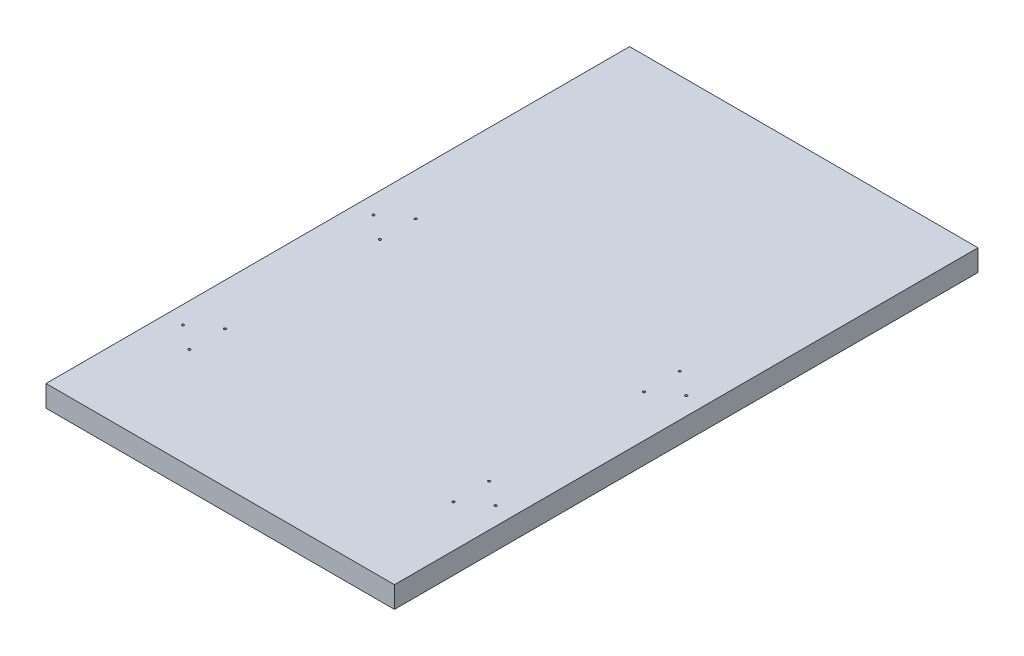
ISO-10303-21;
HEADER;
FILE_DESCRIPTION(('STEP AP214'),'2;1');
FILE_NAME('part.step','',(''),(''),'','','');
FILE_SCHEMA(('AUTOMOTIVE_DESIGN { 1 0 10303 214 1 1 1 1 }'));
ENDSEC;
DATA;
#1=APPLICATION_CONTEXT('core data for automotive mechanical design processes');
#2=APPLICATION_PROTOCOL_DEFINITION('international standard','automotive_design',2000,#1);
#3=PRODUCT_CONTEXT('',#1,'mechanical');
#4=PRODUCT('Part','Part','',(#3));
#5=PRODUCT_RELATED_PRODUCT_CATEGORY('part','',(#4));
#6=PRODUCT_DEFINITION_FORMATION('','',#4);
#7=PRODUCT_DEFINITION_CONTEXT('part definition',#1,'design');
#8=PRODUCT_DEFINITION('design','',#6,#7);
#9=PRODUCT_DEFINITION_SHAPE('','',#8);
#10=(LENGTH_UNIT() NAMED_UNIT(*) SI_UNIT(.MILLI.,.METRE.));
#11=(NAMED_UNIT(*) PLANE_ANGLE_UNIT() SI_UNIT($,.RADIAN.));
#12=(NAMED_UNIT(*) SI_UNIT($,.STERADIAN.) SOLID_ANGLE_UNIT());
#13=UNCERTAINTY_MEASURE_WITH_UNIT(LENGTH_MEASURE(1.E-05),#10,'distance_accuracy_value','');
#14=(GEOMETRIC_REPRESENTATION_CONTEXT(3) GLOBAL_UNCERTAINTY_ASSIGNED_CONTEXT((#13)) GLOBAL_UNIT_ASSIGNED_CONTEXT((#10,
#11,#12)) REPRESENTATION_CONTEXT('',''));
#15=CARTESIAN_POINT('',(0.,0.,0.));
#16=DIRECTION('',(0.,0.,1.));
#17=DIRECTION('',(1.,0.,0.));
#18=AXIS2_PLACEMENT_3D('',#15,#16,#17);
#19=CARTESIAN_POINT('',(0.,18.,0.));
#20=DIRECTION('',(0.,-1.,0.));
#21=DIRECTION('',(0.,0.,-1.));
#22=AXIS2_PLACEMENT_3D('',#19,#20,#21);
#23=PLANE('',#22);
#24=CARTESIAN_POINT('',(118.714236711216,18.,-40.));
#25=DIRECTION('',(0.,1.,0.));
#26=DIRECTION('',(0.,0.,1.));
#27=AXIS2_PLACEMENT_3D('',#24,#25,#26);
#28=CIRCLE('',#27,0.999999999999941);
#29=CARTESIAN_POINT('',(118.714236711216,18.,-39.));
#30=VERTEX_POINT('',#29);
#31=EDGE_CURVE('E45',#30,#30,#28,.T.);
#32=ORIENTED_EDGE('',*,*,#31,.F.);
#33=EDGE_LOOP('',(#32));
#34=FACE_BOUND('',#33,.T.);
#35=CARTESIAN_POINT('',(118.714236711216,18.,-200.));
#36=DIRECTION('',(0.,1.,0.));
#37=DIRECTION('',(0.,0.,-1.));
#38=AXIS2_PLACEMENT_3D('',#35,#36,#37);
#39=CIRCLE('',#38,0.999999999999911);
#40=CARTESIAN_POINT('',(118.714236711216,18.,-201.));
#41=VERTEX_POINT('',#40);
#42=EDGE_CURVE('E131',#41,#41,#39,.T.);
#43=ORIENTED_EDGE('',*,*,#42,.F.);
#44=EDGE_LOOP('',(#43));
#45=FACE_BOUND('',#44,.T.);
#46=CARTESIAN_POINT('',(139.14,18.,-215.));
#47=DIRECTION('',(0.,1.,0.));
#48=DIRECTION('',(0.,0.,-1.));
#49=AXIS2_PLACEMENT_3D('',#46,#47,#48);
#50=CIRCLE('',#49,0.999999999999937);
#51=CARTESIAN_POINT('',(139.14,18.,-216.));
#52=VERTEX_POINT('',#51);
#53=EDGE_CURVE('E125',#52,#52,#50,.T.);
#54=ORIENTED_EDGE('',*,*,#53,.F.);
#55=EDGE_LOOP('',(#54));
#56=FACE_BOUND('',#55,.T.);
#57=CARTESIAN_POINT('',(381.285763288784,18.,-40.));
#58=DIRECTION('',(0.,1.,0.));
#59=DIRECTION('',(0.,0.,-1.));
#60=AXIS2_PLACEMENT_3D('',#57,#58,#59);
#61=CIRCLE('',#60,0.999999999999941);
#62=CARTESIAN_POINT('',(381.285763288784,18.,-40.9999999999999));
#63=VERTEX_POINT('',#62);
#64=EDGE_CURVE('E118',#63,#63,#61,.T.);
#65=ORIENTED_EDGE('',*,*,#64,.F.);
#66=EDGE_LOOP('',(#65));
#67=FACE_BOUND('',#66,.T.);
#68=CARTESIAN_POINT('',(139.14,18.,-25.));
#69=DIRECTION('',(0.,1.,0.));
#70=DIRECTION('',(0.,0.,1.));
#71=AXIS2_PLACEMENT_3D('',#68,#69,#70);
#72=CIRCLE('',#71,0.99999999999994);
#73=CARTESIAN_POINT('',(139.14,18.,-24.));
#74=VERTEX_POINT('',#73);
#75=EDGE_CURVE('E160',#74,#74,#72,.T.);
#76=ORIENTED_EDGE('',*,*,#75,.F.);
#77=EDGE_LOOP('',(#76));
#78=FACE_BOUND('',#77,.T.);
#79=CARTESIAN_POINT('',(139.14,18.,-55.));
#80=DIRECTION('',(0.,1.,0.));
#81=DIRECTION('',(0.,0.,1.));
#82=AXIS2_PLACEMENT_3D('',#79,#80,#81);
#83=CIRCLE('',#82,1.00000000000006);
#84=CARTESIAN_POINT('',(139.14,18.,-53.9999999999999));
#85=VERTEX_POINT('',#84);
#86=EDGE_CURVE('E166',#85,#85,#83,.T.);
#87=ORIENTED_EDGE('',*,*,#86,.F.);
#88=EDGE_LOOP('',(#87));
#89=FACE_BOUND('',#88,.T.);
#90=CARTESIAN_POINT('',(381.285763288784,18.,-200.));
#91=DIRECTION('',(0.,1.,0.));
#92=DIRECTION('',(0.,0.,1.));
#93=AXIS2_PLACEMENT_3D('',#90,#91,#92);
#94=CIRCLE('',#93,0.999999999999937);
#95=CARTESIAN_POINT('',(381.285763288784,18.,-199.));
#96=VERTEX_POINT('',#95);
#97=EDGE_CURVE('E172',#96,#96,#94,.T.);
#98=ORIENTED_EDGE('',*,*,#97,.F.);
#99=EDGE_LOOP('',(#98));
#100=FACE_BOUND('',#99,.T.);
#101=CARTESIAN_POINT('',(360.86,18.,-215.));
#102=DIRECTION('',(0.,1.,0.));
#103=DIRECTION('',(0.,0.,1.));
#104=AXIS2_PLACEMENT_3D('',#101,#102,#103);
#105=CIRCLE('',#104,0.999999999999937);
#106=CARTESIAN_POINT('',(360.86,18.,-214.));
#107=VERTEX_POINT('',#106);
#108=EDGE_CURVE('E178',#107,#107,#105,.T.);
#109=ORIENTED_EDGE('',*,*,#108,.F.);
#110=EDGE_LOOP('',(#109));
#111=FACE_BOUND('',#110,.T.);
#112=CARTESIAN_POINT('',(360.86,18.,-185.));
#113=DIRECTION('',(0.,1.,0.));
#114=DIRECTION('',(0.,0.,1.));
#115=AXIS2_PLACEMENT_3D('',#112,#113,#114);
#116=CIRCLE('',#115,1.00000000000006);
#117=CARTESIAN_POINT('',(360.86,18.,-184.));
#118=VERTEX_POINT('',#117);
#119=EDGE_CURVE('E136',#118,#118,#116,.T.);
#120=ORIENTED_EDGE('',*,*,#119,.F.);
#121=EDGE_LOOP('',(#120));
#122=FACE_BOUND('',#121,.T.);
#123=CARTESIAN_POINT('',(139.14,18.,-185.));
#124=DIRECTION('',(0.,1.,0.));
#125=DIRECTION('',(0.,0.,-1.));
#126=AXIS2_PLACEMENT_3D('',#123,#124,#125);
#127=CIRCLE('',#126,1.00000000000006);
#128=CARTESIAN_POINT('',(139.14,18.,-186.));
#129=VERTEX_POINT('',#128);
#130=EDGE_CURVE('E143',#129,#129,#127,.T.);
#131=ORIENTED_EDGE('',*,*,#130,.F.);
#132=EDGE_LOOP('',(#131));
#133=FACE_BOUND('',#132,.T.);
#134=CARTESIAN_POINT('',(360.86,18.,-55.));
#135=DIRECTION('',(0.,1.,0.));
#136=DIRECTION('',(0.,0.,-1.));
#137=AXIS2_PLACEMENT_3D('',#134,#135,#136);
#138=CIRCLE('',#137,1.00000000000006);
#139=CARTESIAN_POINT('',(360.86,18.,-56.0000000000001));
#140=VERTEX_POINT('',#139);
#141=EDGE_CURVE('E149',#140,#140,#138,.T.);
#142=ORIENTED_EDGE('',*,*,#141,.F.);
#143=EDGE_LOOP('',(#142));
#144=FACE_BOUND('',#143,.T.);
#145=CARTESIAN_POINT('',(360.86,18.,-25.));
#146=DIRECTION('',(0.,1.,0.));
#147=DIRECTION('',(0.,0.,-1.));
#148=AXIS2_PLACEMENT_3D('',#145,#146,#147);
#149=CIRCLE('',#148,0.99999999999994);
#150=CARTESIAN_POINT('',(360.86,18.,-25.9999999999999));
#151=VERTEX_POINT('',#150);
#152=EDGE_CURVE('E155',#151,#151,#149,.T.);
#153=ORIENTED_EDGE('',*,*,#152,.F.);
#154=EDGE_LOOP('',(#153));
#155=FACE_BOUND('',#154,.T.);
#156=DIRECTION('',(0.,0.,1.));
#157=VECTOR('',#156,1.);
#158=CARTESIAN_POINT('',(103.714236711216,18.,-230.));
#159=LINE('',#158,#157);
#160=CARTESIAN_POINT('',(103.714236711216,18.,-430.));
#161=VERTEX_POINT('',#160);
#162=CARTESIAN_POINT('',(103.714236711216,18.,60.));
#163=VERTEX_POINT('',#162);
#164=EDGE_CURVE('E64',#161,#163,#159,.T.);
#165=ORIENTED_EDGE('',*,*,#164,.T.);
#166=DIRECTION('',(-1.,0.,0.));
#167=VECTOR('',#166,1.);
#168=CARTESIAN_POINT('',(103.714236711216,18.,60.));
#169=LINE('',#168,#167);
#170=CARTESIAN_POINT('',(396.285763288784,18.,60.));
#171=VERTEX_POINT('',#170);
#172=EDGE_CURVE('E101',#171,#163,#169,.T.);
#173=ORIENTED_EDGE('',*,*,#172,.F.);
#174=DIRECTION('',(0.,0.,-1.));
#175=VECTOR('',#174,1.);
#176=CARTESIAN_POINT('',(396.285763288784,18.,-230.));
#177=LINE('',#176,#175);
#178=CARTESIAN_POINT('',(396.285763288784,18.,-430.));
#179=VERTEX_POINT('',#178);
#180=EDGE_CURVE('E56',#171,#179,#177,.T.);
#181=ORIENTED_EDGE('',*,*,#180,.T.);
#182=DIRECTION('',(1.,0.,0.));
#183=VECTOR('',#182,1.);
#184=CARTESIAN_POINT('',(396.285763288784,18.,-430.));
#185=LINE('',#184,#183);
#186=EDGE_CURVE('E112',#161,#179,#185,.T.);
#187=ORIENTED_EDGE('',*,*,#186,.F.);
#188=EDGE_LOOP('',(#165,#173,#181,#187));
#189=FACE_BOUND('',#188,.T.);
#190=ADVANCED_FACE('F41',(#34,#45,#56,#67,#78,#89,#100,#111,#122,#133,#144,#155,#189),#23,.F.);
#191=CARTESIAN_POINT('',(0.,0.,0.));
#192=DIRECTION('',(0.,-1.,0.));
#193=DIRECTION('',(0.,0.,-1.));
#194=AXIS2_PLACEMENT_3D('',#191,#192,#193);
#195=PLANE('',#194);
#196=CARTESIAN_POINT('',(118.714236711216,0.,-40.));
#197=DIRECTION('',(0.,1.,0.));
#198=DIRECTION('',(0.,0.,1.));
#199=AXIS2_PLACEMENT_3D('',#196,#197,#198);
#200=CIRCLE('',#199,0.999999999999941);
#201=CARTESIAN_POINT('',(118.714236711216,0.,-39.));
#202=VERTEX_POINT('',#201);
#203=EDGE_CURVE('E11',#202,#202,#200,.T.);
#204=ORIENTED_EDGE('',*,*,#203,.T.);
#205=EDGE_LOOP('',(#204));
#206=FACE_BOUND('',#205,.T.);
#207=CARTESIAN_POINT('',(118.714236711216,0.,-200.));
#208=DIRECTION('',(0.,1.,0.));
#209=DIRECTION('',(0.,0.,-1.));
#210=AXIS2_PLACEMENT_3D('',#207,#208,#209);
#211=CIRCLE('',#210,0.999999999999911);
#212=CARTESIAN_POINT('',(118.714236711216,0.,-201.));
#213=VERTEX_POINT('',#212);
#214=EDGE_CURVE('E115',#213,#213,#211,.T.);
#215=ORIENTED_EDGE('',*,*,#214,.T.);
#216=EDGE_LOOP('',(#215));
#217=FACE_BOUND('',#216,.T.);
#218=CARTESIAN_POINT('',(139.14,0.,-215.));
#219=DIRECTION('',(0.,1.,0.));
#220=DIRECTION('',(0.,0.,-1.));
#221=AXIS2_PLACEMENT_3D('',#218,#219,#220);
#222=CIRCLE('',#221,0.999999999999937);
#223=CARTESIAN_POINT('',(139.14,0.,-216.));
#224=VERTEX_POINT('',#223);
#225=EDGE_CURVE('E128',#224,#224,#222,.T.);
#226=ORIENTED_EDGE('',*,*,#225,.T.);
#227=EDGE_LOOP('',(#226));
#228=FACE_BOUND('',#227,.T.);
#229=CARTESIAN_POINT('',(381.285763288784,0.,-40.));
#230=DIRECTION('',(0.,1.,0.));
#231=DIRECTION('',(0.,0.,-1.));
#232=AXIS2_PLACEMENT_3D('',#229,#230,#231);
#233=CIRCLE('',#232,0.999999999999941);
#234=CARTESIAN_POINT('',(381.285763288784,0.,-40.9999999999999));
#235=VERTEX_POINT('',#234);
#236=EDGE_CURVE('E122',#235,#235,#233,.T.);
#237=ORIENTED_EDGE('',*,*,#236,.T.);
#238=EDGE_LOOP('',(#237));
#239=FACE_BOUND('',#238,.T.);
#240=CARTESIAN_POINT('',(139.14,0.,-25.));
#241=DIRECTION('',(0.,1.,0.));
#242=DIRECTION('',(0.,0.,1.));
#243=AXIS2_PLACEMENT_3D('',#240,#241,#242);
#244=CIRCLE('',#243,0.99999999999994);
#245=CARTESIAN_POINT('',(139.14,0.,-24.));
#246=VERTEX_POINT('',#245);
#247=EDGE_CURVE('E163',#246,#246,#244,.T.);
#248=ORIENTED_EDGE('',*,*,#247,.T.);
#249=EDGE_LOOP('',(#248));
#250=FACE_BOUND('',#249,.T.);
#251=CARTESIAN_POINT('',(139.14,0.,-55.));
#252=DIRECTION('',(0.,1.,0.));
#253=DIRECTION('',(0.,0.,1.));
#254=AXIS2_PLACEMENT_3D('',#251,#252,#253);
#255=CIRCLE('',#254,1.00000000000006);
#256=CARTESIAN_POINT('',(139.14,0.,-53.9999999999999));
#257=VERTEX_POINT('',#256);
#258=EDGE_CURVE('E169',#257,#257,#255,.T.);
#259=ORIENTED_EDGE('',*,*,#258,.T.);
#260=EDGE_LOOP('',(#259));
#261=FACE_BOUND('',#260,.T.);
#262=CARTESIAN_POINT('',(381.285763288784,0.,-200.));
#263=DIRECTION('',(0.,1.,0.));
#264=DIRECTION('',(0.,0.,1.));
#265=AXIS2_PLACEMENT_3D('',#262,#263,#264);
#266=CIRCLE('',#265,0.999999999999937);
#267=CARTESIAN_POINT('',(381.285763288784,0.,-199.));
#268=VERTEX_POINT('',#267);
#269=EDGE_CURVE('E175',#268,#268,#266,.T.);
#270=ORIENTED_EDGE('',*,*,#269,.T.);
#271=EDGE_LOOP('',(#270));
#272=FACE_BOUND('',#271,.T.);
#273=CARTESIAN_POINT('',(360.86,0.,-215.));
#274=DIRECTION('',(0.,1.,0.));
#275=DIRECTION('',(0.,0.,1.));
#276=AXIS2_PLACEMENT_3D('',#273,#274,#275);
#277=CIRCLE('',#276,0.999999999999937);
#278=CARTESIAN_POINT('',(360.86,0.,-214.));
#279=VERTEX_POINT('',#278);
#280=EDGE_CURVE('E139',#279,#279,#277,.T.);
#281=ORIENTED_EDGE('',*,*,#280,.T.);
#282=EDGE_LOOP('',(#281));
#283=FACE_BOUND('',#282,.T.);
#284=CARTESIAN_POINT('',(360.86,0.,-185.));
#285=DIRECTION('',(0.,1.,0.));
#286=DIRECTION('',(0.,0.,1.));
#287=AXIS2_PLACEMENT_3D('',#284,#285,#286);
#288=CIRCLE('',#287,1.00000000000006);
#289=CARTESIAN_POINT('',(360.86,0.,-184.));
#290=VERTEX_POINT('',#289);
#291=EDGE_CURVE('E140',#290,#290,#288,.T.);
#292=ORIENTED_EDGE('',*,*,#291,.T.);
#293=EDGE_LOOP('',(#292));
#294=FACE_BOUND('',#293,.T.);
#295=CARTESIAN_POINT('',(139.14,0.,-185.));
#296=DIRECTION('',(0.,1.,0.));
#297=DIRECTION('',(0.,0.,-1.));
#298=AXIS2_PLACEMENT_3D('',#295,#296,#297);
#299=CIRCLE('',#298,1.00000000000006);
#300=CARTESIAN_POINT('',(139.14,0.,-186.));
#301=VERTEX_POINT('',#300);
#302=EDGE_CURVE('E146',#301,#301,#299,.T.);
#303=ORIENTED_EDGE('',*,*,#302,.T.);
#304=EDGE_LOOP('',(#303));
#305=FACE_BOUND('',#304,.T.);
#306=CARTESIAN_POINT('',(360.86,0.,-55.));
#307=DIRECTION('',(0.,1.,0.));
#308=DIRECTION('',(0.,0.,-1.));
#309=AXIS2_PLACEMENT_3D('',#306,#307,#308);
#310=CIRCLE('',#309,1.00000000000006);
#311=CARTESIAN_POINT('',(360.86,0.,-56.0000000000001));
#312=VERTEX_POINT('',#311);
#313=EDGE_CURVE('E152',#312,#312,#310,.T.);
#314=ORIENTED_EDGE('',*,*,#313,.T.);
#315=EDGE_LOOP('',(#314));
#316=FACE_BOUND('',#315,.T.);
#317=CARTESIAN_POINT('',(360.86,0.,-25.));
#318=DIRECTION('',(0.,1.,0.));
#319=DIRECTION('',(0.,0.,-1.));
#320=AXIS2_PLACEMENT_3D('',#317,#318,#319);
#321=CIRCLE('',#320,0.99999999999994);
#322=CARTESIAN_POINT('',(360.86,0.,-25.9999999999999));
#323=VERTEX_POINT('',#322);
#324=EDGE_CURVE('E121',#323,#323,#321,.T.);
#325=ORIENTED_EDGE('',*,*,#324,.T.);
#326=EDGE_LOOP('',(#325));
#327=FACE_BOUND('',#326,.T.);
#328=DIRECTION('',(0.,0.,-1.));
#329=VECTOR('',#328,1.);
#330=CARTESIAN_POINT('',(396.285763288784,0.,-230.));
#331=LINE('',#330,#329);
#332=CARTESIAN_POINT('',(396.285763288784,0.,60.));
#333=VERTEX_POINT('',#332);
#334=CARTESIAN_POINT('',(396.285763288784,0.,-430.));
#335=VERTEX_POINT('',#334);
#336=EDGE_CURVE('E90',#333,#335,#331,.T.);
#337=ORIENTED_EDGE('',*,*,#336,.F.);
#338=DIRECTION('',(1.,0.,0.));
#339=VECTOR('',#338,1.);
#340=CARTESIAN_POINT('',(103.714236711216,0.,60.));
#341=LINE('',#340,#339);
#342=CARTESIAN_POINT('',(103.714236711216,0.,60.));
#343=VERTEX_POINT('',#342);
#344=EDGE_CURVE('E93',#343,#333,#341,.T.);
#345=ORIENTED_EDGE('',*,*,#344,.F.);
#346=DIRECTION('',(0.,0.,1.));
#347=VECTOR('',#346,1.);
#348=CARTESIAN_POINT('',(103.714236711216,0.,-230.));
#349=LINE('',#348,#347);
#350=CARTESIAN_POINT('',(103.714236711216,0.,-430.));
#351=VERTEX_POINT('',#350);
#352=EDGE_CURVE('E81',#351,#343,#349,.T.);
#353=ORIENTED_EDGE('',*,*,#352,.F.);
#354=DIRECTION('',(-1.,0.,0.));
#355=VECTOR('',#354,1.);
#356=CARTESIAN_POINT('',(396.285763288784,0.,-430.));
#357=LINE('',#356,#355);
#358=EDGE_CURVE('E109',#335,#351,#357,.T.);
#359=ORIENTED_EDGE('',*,*,#358,.F.);
#360=EDGE_LOOP('',(#337,#345,#353,#359));
#361=FACE_BOUND('',#360,.T.);
#362=ADVANCED_FACE('F43',(#206,#217,#228,#239,#250,#261,#272,#283,#294,#305,#316,#327,#361),
#195,.T.);
#363=CARTESIAN_POINT('',(118.714236711216,0.,-40.));
#364=DIRECTION('',(0.,1.,0.));
#365=DIRECTION('',(0.,0.,1.));
#366=AXIS2_PLACEMENT_3D('',#363,#364,#365);
#367=CYLINDRICAL_SURFACE('',#366,0.999999999999941);
#368=ORIENTED_EDGE('',*,*,#203,.F.);
#369=EDGE_LOOP('',(#368));
#370=FACE_BOUND('',#369,.T.);
#371=ORIENTED_EDGE('',*,*,#31,.T.);
#372=EDGE_LOOP('',(#371));
#373=FACE_BOUND('',#372,.T.);
#374=ADVANCED_FACE('F233',(#370,#373),#367,.F.);
#375=CARTESIAN_POINT('',(118.714236711216,0.,-200.));
#376=DIRECTION('',(0.,1.,0.));
#377=DIRECTION('',(0.,0.,1.));
#378=AXIS2_PLACEMENT_3D('',#375,#376,#377);
#379=CYLINDRICAL_SURFACE('',#378,0.999999999999911);
#380=ORIENTED_EDGE('',*,*,#214,.F.);
#381=EDGE_LOOP('',(#380));
#382=FACE_BOUND('',#381,.T.);
#383=ORIENTED_EDGE('',*,*,#42,.T.);
#384=EDGE_LOOP('',(#383));
#385=FACE_BOUND('',#384,.T.);
#386=ADVANCED_FACE('F229',(#382,#385),#379,.F.);
#387=CARTESIAN_POINT('',(139.14,0.,-215.));
#388=DIRECTION('',(0.,1.,0.));
#389=DIRECTION('',(0.,0.,1.));
#390=AXIS2_PLACEMENT_3D('',#387,#388,#389);
#391=CYLINDRICAL_SURFACE('',#390,0.999999999999937);
#392=ORIENTED_EDGE('',*,*,#225,.F.);
#393=EDGE_LOOP('',(#392));
#394=FACE_BOUND('',#393,.T.);
#395=ORIENTED_EDGE('',*,*,#53,.T.);
#396=EDGE_LOOP('',(#395));
#397=FACE_BOUND('',#396,.T.);
#398=ADVANCED_FACE('F225',(#394,#397),#391,.F.);
#399=CARTESIAN_POINT('',(381.285763288784,0.,-40.));
#400=DIRECTION('',(0.,1.,0.));
#401=DIRECTION('',(0.,0.,1.));
#402=AXIS2_PLACEMENT_3D('',#399,#400,#401);
#403=CYLINDRICAL_SURFACE('',#402,0.999999999999941);
#404=ORIENTED_EDGE('',*,*,#236,.F.);
#405=EDGE_LOOP('',(#404));
#406=FACE_BOUND('',#405,.T.);
#407=ORIENTED_EDGE('',*,*,#64,.T.);
#408=EDGE_LOOP('',(#407));
#409=FACE_BOUND('',#408,.T.);
#410=ADVANCED_FACE('F221',(#406,#409),#403,.F.);
#411=CARTESIAN_POINT('',(139.14,0.,-25.));
#412=DIRECTION('',(0.,1.,0.));
#413=DIRECTION('',(0.,0.,1.));
#414=AXIS2_PLACEMENT_3D('',#411,#412,#413);
#415=CYLINDRICAL_SURFACE('',#414,0.99999999999994);
#416=ORIENTED_EDGE('',*,*,#247,.F.);
#417=EDGE_LOOP('',(#416));
#418=FACE_BOUND('',#417,.T.);
#419=ORIENTED_EDGE('',*,*,#75,.T.);
#420=EDGE_LOOP('',(#419));
#421=FACE_BOUND('',#420,.T.);
#422=ADVANCED_FACE('F224',(#418,#421),#415,.F.);
#423=CARTESIAN_POINT('',(139.14,0.,-55.));
#424=DIRECTION('',(0.,1.,0.));
#425=DIRECTION('',(0.,0.,1.));
#426=AXIS2_PLACEMENT_3D('',#423,#424,#425);
#427=CYLINDRICAL_SURFACE('',#426,1.00000000000006);
#428=ORIENTED_EDGE('',*,*,#258,.F.);
#429=EDGE_LOOP('',(#428));
#430=FACE_BOUND('',#429,.T.);
#431=ORIENTED_EDGE('',*,*,#86,.T.);
#432=EDGE_LOOP('',(#431));
#433=FACE_BOUND('',#432,.T.);
#434=ADVANCED_FACE('F251',(#430,#433),#427,.F.);
#435=CARTESIAN_POINT('',(381.285763288784,0.,-200.));
#436=DIRECTION('',(0.,1.,0.));
#437=DIRECTION('',(0.,0.,1.));
#438=AXIS2_PLACEMENT_3D('',#435,#436,#437);
#439=CYLINDRICAL_SURFACE('',#438,0.999999999999937);
#440=ORIENTED_EDGE('',*,*,#269,.F.);
#441=EDGE_LOOP('',(#440));
#442=FACE_BOUND('',#441,.T.);
#443=ORIENTED_EDGE('',*,*,#97,.T.);
#444=EDGE_LOOP('',(#443));
#445=FACE_BOUND('',#444,.T.);
#446=ADVANCED_FACE('F190',(#442,#445),#439,.F.);
#447=CARTESIAN_POINT('',(360.86,0.,-215.));
#448=DIRECTION('',(0.,1.,0.));
#449=DIRECTION('',(0.,0.,1.));
#450=AXIS2_PLACEMENT_3D('',#447,#448,#449);
#451=CYLINDRICAL_SURFACE('',#450,0.999999999999937);
#452=ORIENTED_EDGE('',*,*,#280,.F.);
#453=EDGE_LOOP('',(#452));
#454=FACE_BOUND('',#453,.T.);
#455=ORIENTED_EDGE('',*,*,#108,.T.);
#456=EDGE_LOOP('',(#455));
#457=FACE_BOUND('',#456,.T.);
#458=ADVANCED_FACE('F186',(#454,#457),#451,.F.);
#459=CARTESIAN_POINT('',(360.86,0.,-185.));
#460=DIRECTION('',(0.,1.,0.));
#461=DIRECTION('',(0.,0.,1.));
#462=AXIS2_PLACEMENT_3D('',#459,#460,#461);
#463=CYLINDRICAL_SURFACE('',#462,1.00000000000006);
#464=ORIENTED_EDGE('',*,*,#291,.F.);
#465=EDGE_LOOP('',(#464));
#466=FACE_BOUND('',#465,.T.);
#467=ORIENTED_EDGE('',*,*,#119,.T.);
#468=EDGE_LOOP('',(#467));
#469=FACE_BOUND('',#468,.T.);
#470=ADVANCED_FACE('F189',(#466,#469),#463,.F.);
#471=CARTESIAN_POINT('',(139.14,0.,-185.));
#472=DIRECTION('',(0.,1.,0.));
#473=DIRECTION('',(0.,0.,1.));
#474=AXIS2_PLACEMENT_3D('',#471,#472,#473);
#475=CYLINDRICAL_SURFACE('',#474,1.00000000000006);
#476=ORIENTED_EDGE('',*,*,#302,.F.);
#477=EDGE_LOOP('',(#476));
#478=FACE_BOUND('',#477,.T.);
#479=ORIENTED_EDGE('',*,*,#130,.T.);
#480=EDGE_LOOP('',(#479));
#481=FACE_BOUND('',#480,.T.);
#482=ADVANCED_FACE('F237',(#478,#481),#475,.F.);
#483=CARTESIAN_POINT('',(360.86,0.,-55.));
#484=DIRECTION('',(0.,1.,0.));
#485=DIRECTION('',(0.,0.,1.));
#486=AXIS2_PLACEMENT_3D('',#483,#484,#485);
#487=CYLINDRICAL_SURFACE('',#486,1.00000000000006);
#488=ORIENTED_EDGE('',*,*,#313,.F.);
#489=EDGE_LOOP('',(#488));
#490=FACE_BOUND('',#489,.T.);
#491=ORIENTED_EDGE('',*,*,#141,.T.);
#492=EDGE_LOOP('',(#491));
#493=FACE_BOUND('',#492,.T.);
#494=ADVANCED_FACE('F241',(#490,#493),#487,.F.);
#495=CARTESIAN_POINT('',(360.86,0.,-25.));
#496=DIRECTION('',(0.,1.,0.));
#497=DIRECTION('',(0.,0.,1.));
#498=AXIS2_PLACEMENT_3D('',#495,#496,#497);
#499=CYLINDRICAL_SURFACE('',#498,0.99999999999994);
#500=ORIENTED_EDGE('',*,*,#324,.F.);
#501=EDGE_LOOP('',(#500));
#502=FACE_BOUND('',#501,.T.);
#503=ORIENTED_EDGE('',*,*,#152,.T.);
#504=EDGE_LOOP('',(#503));
#505=FACE_BOUND('',#504,.T.);
#506=ADVANCED_FACE('F217',(#502,#505),#499,.F.);
#507=CARTESIAN_POINT('',(103.714236711216,0.,-230.));
#508=DIRECTION('',(-1.,0.,0.));
#509=DIRECTION('',(0.,0.,1.));
#510=AXIS2_PLACEMENT_3D('',#507,#508,#509);
#511=PLANE('',#510);
#512=ORIENTED_EDGE('',*,*,#164,.F.);
#513=DIRECTION('',(0.,1.,0.));
#514=VECTOR('',#513,1.);
#515=CARTESIAN_POINT('',(103.714236711216,18.,-430.));
#516=LINE('',#515,#514);
#517=EDGE_CURVE('E86',#351,#161,#516,.T.);
#518=ORIENTED_EDGE('',*,*,#517,.F.);
#519=ORIENTED_EDGE('',*,*,#352,.T.);
#520=DIRECTION('',(0.,-1.,0.));
#521=VECTOR('',#520,1.);
#522=CARTESIAN_POINT('',(103.714236711216,0.,60.));
#523=LINE('',#522,#521);
#524=EDGE_CURVE('E85',#163,#343,#523,.T.);
#525=ORIENTED_EDGE('',*,*,#524,.F.);
#526=EDGE_LOOP('',(#512,#518,#519,#525));
#527=FACE_BOUND('',#526,.T.);
#528=ADVANCED_FACE('F83',(#527),#511,.T.);
#529=CARTESIAN_POINT('',(396.285763288784,0.,-230.));
#530=DIRECTION('',(1.,0.,0.));
#531=DIRECTION('',(0.,0.,-1.));
#532=AXIS2_PLACEMENT_3D('',#529,#530,#531);
#533=PLANE('',#532);
#534=ORIENTED_EDGE('',*,*,#180,.F.);
#535=DIRECTION('',(0.,1.,0.));
#536=VECTOR('',#535,1.);
#537=CARTESIAN_POINT('',(396.285763288784,0.,60.));
#538=LINE('',#537,#536);
#539=EDGE_CURVE('E97',#333,#171,#538,.T.);
#540=ORIENTED_EDGE('',*,*,#539,.F.);
#541=ORIENTED_EDGE('',*,*,#336,.T.);
#542=DIRECTION('',(0.,-1.,0.));
#543=VECTOR('',#542,1.);
#544=CARTESIAN_POINT('',(396.285763288784,18.,-430.));
#545=LINE('',#544,#543);
#546=EDGE_CURVE('E106',#179,#335,#545,.T.);
#547=ORIENTED_EDGE('',*,*,#546,.F.);
#548=EDGE_LOOP('',(#534,#540,#541,#547));
#549=FACE_BOUND('',#548,.T.);
#550=ADVANCED_FACE('F208',(#549),#533,.T.);
#551=CARTESIAN_POINT('',(0.,0.,-430.));
#552=DIRECTION('',(0.,0.,-1.));
#553=DIRECTION('',(-1.,0.,0.));
#554=AXIS2_PLACEMENT_3D('',#551,#552,#553);
#555=PLANE('',#554);
#556=ORIENTED_EDGE('',*,*,#546,.T.);
#557=ORIENTED_EDGE('',*,*,#358,.T.);
#558=ORIENTED_EDGE('',*,*,#517,.T.);
#559=ORIENTED_EDGE('',*,*,#186,.T.);
#560=EDGE_LOOP('',(#556,#557,#558,#559));
#561=FACE_BOUND('',#560,.T.);
#562=ADVANCED_FACE('F206',(#561),#555,.T.);
#563=CARTESIAN_POINT('',(0.,0.,60.));
#564=DIRECTION('',(0.,0.,-1.));
#565=DIRECTION('',(-1.,0.,0.));
#566=AXIS2_PLACEMENT_3D('',#563,#564,#565);
#567=PLANE('',#566);
#568=ORIENTED_EDGE('',*,*,#524,.T.);
#569=ORIENTED_EDGE('',*,*,#344,.T.);
#570=ORIENTED_EDGE('',*,*,#539,.T.);
#571=ORIENTED_EDGE('',*,*,#172,.T.);
#572=EDGE_LOOP('',(#568,#569,#570,#571));
#573=FACE_BOUND('',#572,.T.);
#574=ADVANCED_FACE('F100',(#573),#567,.F.);
#575=CLOSED_SHELL('',(#190,#362,#374,#386,#398,#410,#422,#434,#446,#458,#470,#482,#494,#506,
#528,#550,#562,#574));
#576=MANIFOLD_SOLID_BREP('B2',#575);
#577=ADVANCED_BREP_SHAPE_REPRESENTATION('',(#18,#576),#14);
#578=SHAPE_DEFINITION_REPRESENTATION(#9,#577);
ENDSEC;
END-ISO-10303-21;
